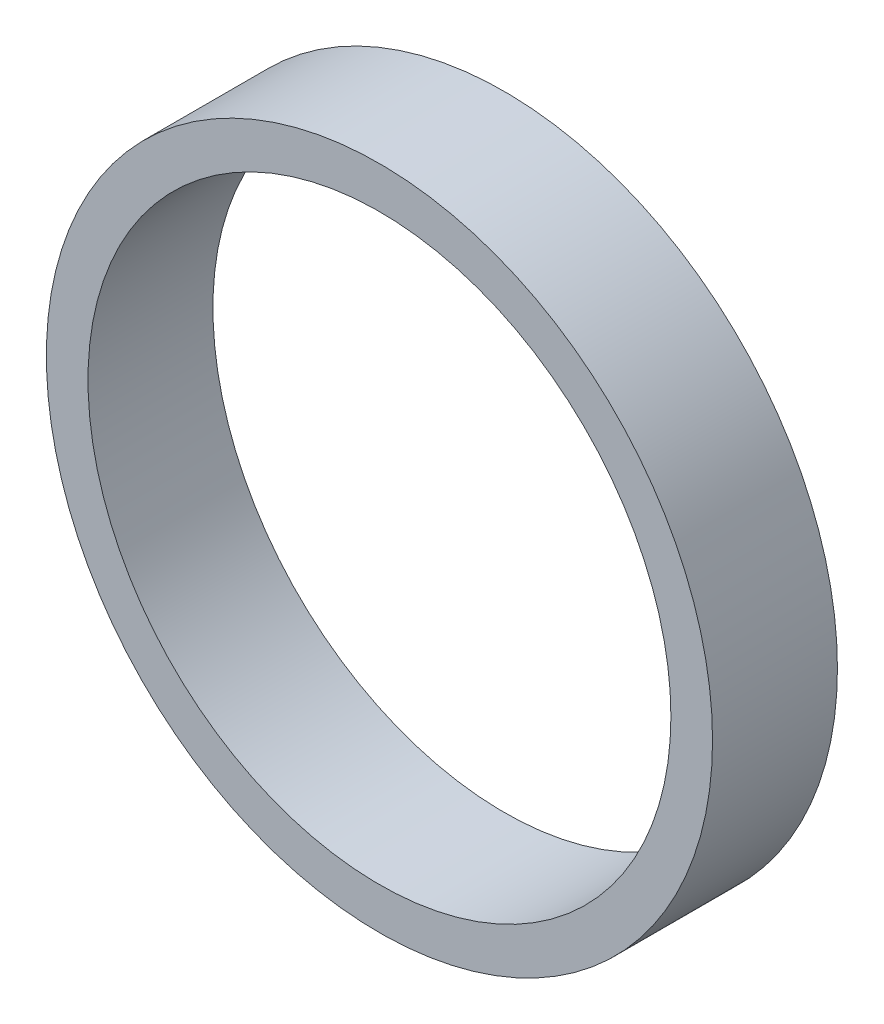
ISO-10303-21;
HEADER;
FILE_DESCRIPTION(('STEP AP214'),'2;1');
FILE_NAME('part.step','',(''),(''),'','','');
FILE_SCHEMA(('AUTOMOTIVE_DESIGN { 1 0 10303 214 1 1 1 1 }'));
ENDSEC;
DATA;
#1=APPLICATION_CONTEXT('core data for automotive mechanical design processes');
#2=APPLICATION_PROTOCOL_DEFINITION('international standard','automotive_design',2000,#1);
#3=PRODUCT_CONTEXT('',#1,'mechanical');
#4=PRODUCT('Part','Part','',(#3));
#5=PRODUCT_RELATED_PRODUCT_CATEGORY('part','',(#4));
#6=PRODUCT_DEFINITION_FORMATION('','',#4);
#7=PRODUCT_DEFINITION_CONTEXT('part definition',#1,'design');
#8=PRODUCT_DEFINITION('design','',#6,#7);
#9=PRODUCT_DEFINITION_SHAPE('','',#8);
#10=(LENGTH_UNIT() NAMED_UNIT(*) SI_UNIT(.MILLI.,.METRE.));
#11=(NAMED_UNIT(*) PLANE_ANGLE_UNIT() SI_UNIT($,.RADIAN.));
#12=(NAMED_UNIT(*) SI_UNIT($,.STERADIAN.) SOLID_ANGLE_UNIT());
#13=UNCERTAINTY_MEASURE_WITH_UNIT(LENGTH_MEASURE(1.E-05),#10,'distance_accuracy_value','');
#14=(GEOMETRIC_REPRESENTATION_CONTEXT(3) GLOBAL_UNCERTAINTY_ASSIGNED_CONTEXT((#13)) GLOBAL_UNIT_ASSIGNED_CONTEXT((#10,
#11,#12)) REPRESENTATION_CONTEXT('',''));
#15=CARTESIAN_POINT('',(0.,0.,0.));
#16=DIRECTION('',(0.,0.,1.));
#17=DIRECTION('',(1.,0.,0.));
#18=AXIS2_PLACEMENT_3D('',#15,#16,#17);
#19=CARTESIAN_POINT('',(0.,0.,6.));
#20=DIRECTION('',(0.,0.,1.));
#21=DIRECTION('',(1.,0.,0.));
#22=AXIS2_PLACEMENT_3D('',#19,#20,#21);
#23=PLANE('',#22);
#24=CARTESIAN_POINT('',(0.,0.,6.));
#25=DIRECTION('',(0.,0.,1.));
#26=DIRECTION('',(1.,0.,0.));
#27=AXIS2_PLACEMENT_3D('',#24,#25,#26);
#28=CIRCLE('',#27,16.);
#29=CARTESIAN_POINT('',(16.,0.,6.));
#30=VERTEX_POINT('',#29);
#31=EDGE_CURVE('E10',#30,#30,#28,.T.);
#32=ORIENTED_EDGE('',*,*,#31,.T.);
#33=EDGE_LOOP('',(#32));
#34=FACE_BOUND('',#33,.T.);
#35=CARTESIAN_POINT('',(0.,0.,6.));
#36=DIRECTION('',(0.,0.,1.));
#37=DIRECTION('',(1.,0.,0.));
#38=AXIS2_PLACEMENT_3D('',#35,#36,#37);
#39=CIRCLE('',#38,14.);
#40=CARTESIAN_POINT('',(14.,0.,6.));
#41=VERTEX_POINT('',#40);
#42=EDGE_CURVE('E45',#41,#41,#39,.T.);
#43=ORIENTED_EDGE('',*,*,#42,.F.);
#44=EDGE_LOOP('',(#43));
#45=FACE_BOUND('',#44,.T.);
#46=ADVANCED_FACE('F34',(#34,#45),#23,.T.);
#47=CARTESIAN_POINT('',(0.,0.,0.));
#48=DIRECTION('',(0.,0.,1.));
#49=DIRECTION('',(1.,0.,0.));
#50=AXIS2_PLACEMENT_3D('',#47,#48,#49);
#51=PLANE('',#50);
#52=CARTESIAN_POINT('',(0.,0.,0.));
#53=DIRECTION('',(0.,0.,1.));
#54=DIRECTION('',(1.,0.,0.));
#55=AXIS2_PLACEMENT_3D('',#52,#53,#54);
#56=CIRCLE('',#55,16.);
#57=CARTESIAN_POINT('',(16.,0.,0.));
#58=VERTEX_POINT('',#57);
#59=EDGE_CURVE('E38',#58,#58,#56,.T.);
#60=ORIENTED_EDGE('',*,*,#59,.F.);
#61=EDGE_LOOP('',(#60));
#62=FACE_BOUND('',#61,.T.);
#63=CARTESIAN_POINT('',(0.,0.,0.));
#64=DIRECTION('',(0.,0.,1.));
#65=DIRECTION('',(1.,0.,0.));
#66=AXIS2_PLACEMENT_3D('',#63,#64,#65);
#67=CIRCLE('',#66,14.);
#68=CARTESIAN_POINT('',(14.,0.,0.));
#69=VERTEX_POINT('',#68);
#70=EDGE_CURVE('E47',#69,#69,#67,.T.);
#71=ORIENTED_EDGE('',*,*,#70,.T.);
#72=EDGE_LOOP('',(#71));
#73=FACE_BOUND('',#72,.T.);
#74=ADVANCED_FACE('F57',(#62,#73),#51,.F.);
#75=CARTESIAN_POINT('',(0.,0.,6.));
#76=DIRECTION('',(0.,0.,-1.));
#77=DIRECTION('',(-1.,0.,0.));
#78=AXIS2_PLACEMENT_3D('',#75,#76,#77);
#79=CYLINDRICAL_SURFACE('',#78,16.);
#80=ORIENTED_EDGE('',*,*,#31,.F.);
#81=EDGE_LOOP('',(#80));
#82=FACE_BOUND('',#81,.T.);
#83=ORIENTED_EDGE('',*,*,#59,.T.);
#84=EDGE_LOOP('',(#83));
#85=FACE_BOUND('',#84,.T.);
#86=ADVANCED_FACE('F36',(#82,#85),#79,.T.);
#87=CARTESIAN_POINT('',(0.,0.,6.));
#88=DIRECTION('',(0.,0.,-1.));
#89=DIRECTION('',(-1.,0.,0.));
#90=AXIS2_PLACEMENT_3D('',#87,#88,#89);
#91=CYLINDRICAL_SURFACE('',#90,14.);
#92=ORIENTED_EDGE('',*,*,#42,.T.);
#93=EDGE_LOOP('',(#92));
#94=FACE_BOUND('',#93,.T.);
#95=ORIENTED_EDGE('',*,*,#70,.F.);
#96=EDGE_LOOP('',(#95));
#97=FACE_BOUND('',#96,.T.);
#98=ADVANCED_FACE('F53',(#94,#97),#91,.F.);
#99=CLOSED_SHELL('',(#46,#74,#86,#98));
#100=MANIFOLD_SOLID_BREP('B2',#99);
#101=ADVANCED_BREP_SHAPE_REPRESENTATION('',(#18,#100),#14);
#102=SHAPE_DEFINITION_REPRESENTATION(#9,#101);
ENDSEC;
END-ISO-10303-21;
